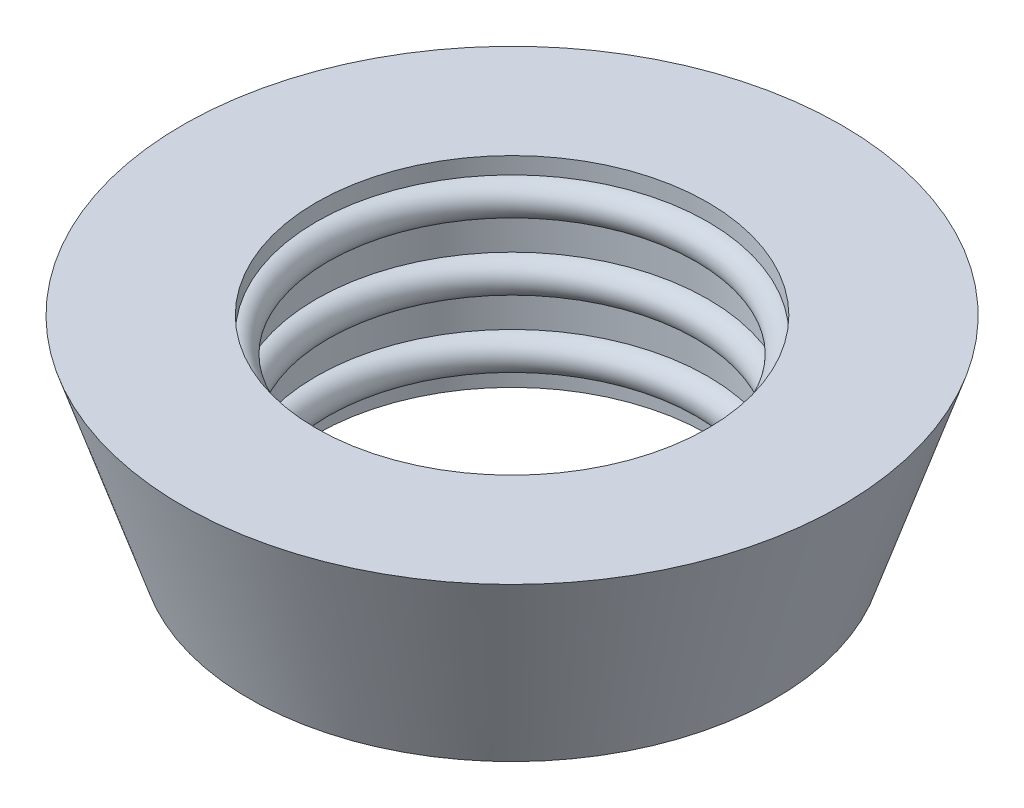
ISO-10303-21;
HEADER;
FILE_DESCRIPTION(('STEP AP214'),'2;1');
FILE_NAME('part.step','',(''),(''),'','','');
FILE_SCHEMA(('AUTOMOTIVE_DESIGN { 1 0 10303 214 1 1 1 1 }'));
ENDSEC;
DATA;
#1=APPLICATION_CONTEXT('core data for automotive mechanical design processes');
#2=APPLICATION_PROTOCOL_DEFINITION('international standard','automotive_design',2000,#1);
#3=PRODUCT_CONTEXT('',#1,'mechanical');
#4=PRODUCT('Part','Part','',(#3));
#5=PRODUCT_RELATED_PRODUCT_CATEGORY('part','',(#4));
#6=PRODUCT_DEFINITION_FORMATION('','',#4);
#7=PRODUCT_DEFINITION_CONTEXT('part definition',#1,'design');
#8=PRODUCT_DEFINITION('design','',#6,#7);
#9=PRODUCT_DEFINITION_SHAPE('','',#8);
#10=(LENGTH_UNIT() NAMED_UNIT(*) SI_UNIT(.MILLI.,.METRE.));
#11=(NAMED_UNIT(*) PLANE_ANGLE_UNIT() SI_UNIT($,.RADIAN.));
#12=(NAMED_UNIT(*) SI_UNIT($,.STERADIAN.) SOLID_ANGLE_UNIT());
#13=UNCERTAINTY_MEASURE_WITH_UNIT(LENGTH_MEASURE(1.E-05),#10,'distance_accuracy_value','');
#14=(GEOMETRIC_REPRESENTATION_CONTEXT(3) GLOBAL_UNCERTAINTY_ASSIGNED_CONTEXT((#13)) GLOBAL_UNIT_ASSIGNED_CONTEXT((#10,
#11,#12)) REPRESENTATION_CONTEXT('',''));
#15=CARTESIAN_POINT('',(0.,0.,0.));
#16=DIRECTION('',(0.,0.,1.));
#17=DIRECTION('',(1.,0.,0.));
#18=AXIS2_PLACEMENT_3D('',#15,#16,#17);
#19=CARTESIAN_POINT('',(0.,0.,0.));
#20=DIRECTION('',(0.,-1.,0.));
#21=DIRECTION('',(0.,0.,-1.));
#22=AXIS2_PLACEMENT_3D('',#19,#20,#21);
#23=CYLINDRICAL_SURFACE('',#22,5.85);
#24=CARTESIAN_POINT('',(0.,0.,0.));
#25=DIRECTION('',(0.,-1.,0.));
#26=DIRECTION('',(0.,0.,-1.));
#27=AXIS2_PLACEMENT_3D('',#24,#25,#26);
#28=CIRCLE('',#27,5.85);
#29=CARTESIAN_POINT('',(0.,0.,-5.85));
#30=VERTEX_POINT('',#29);
#31=EDGE_CURVE('E10',#30,#30,#28,.T.);
#32=ORIENTED_EDGE('',*,*,#31,.T.);
#33=EDGE_LOOP('',(#32));
#34=FACE_BOUND('',#33,.T.);
#35=CARTESIAN_POINT('',(0.,0.5,0.));
#36=DIRECTION('',(0.,-1.,0.));
#37=DIRECTION('',(0.,0.,-1.));
#38=AXIS2_PLACEMENT_3D('',#35,#36,#37);
#39=CIRCLE('',#38,5.85);
#40=CARTESIAN_POINT('',(0.,0.5,-5.85));
#41=VERTEX_POINT('',#40);
#42=EDGE_CURVE('E70',#41,#41,#39,.T.);
#43=ORIENTED_EDGE('',*,*,#42,.F.);
#44=EDGE_LOOP('',(#43));
#45=FACE_BOUND('',#44,.T.);
#46=ADVANCED_FACE('F36',(#34,#45),#23,.F.);
#47=CARTESIAN_POINT('',(5.85,0.,0.));
#48=DIRECTION('',(0.,-1.,0.));
#49=DIRECTION('',(0.,0.,-1.));
#50=AXIS2_PLACEMENT_3D('',#47,#48,#49);
#51=PLANE('',#50);
#52=CARTESIAN_POINT('',(0.,0.,0.));
#53=DIRECTION('',(0.,-1.,0.));
#54=DIRECTION('',(0.,0.,-1.));
#55=AXIS2_PLACEMENT_3D('',#52,#53,#54);
#56=CIRCLE('',#55,7.85);
#57=CARTESIAN_POINT('',(0.,0.,-7.85));
#58=VERTEX_POINT('',#57);
#59=EDGE_CURVE('E42',#58,#58,#56,.T.);
#60=ORIENTED_EDGE('',*,*,#59,.T.);
#61=EDGE_LOOP('',(#60));
#62=FACE_BOUND('',#61,.T.);
#63=ORIENTED_EDGE('',*,*,#31,.F.);
#64=EDGE_LOOP('',(#63));
#65=FACE_BOUND('',#64,.T.);
#66=ADVANCED_FACE('F78',(#62,#65),#51,.T.);
#67=CARTESIAN_POINT('',(0.,0.,0.));
#68=DIRECTION('',(0.,1.,0.));
#69=DIRECTION('',(0.,0.,1.));
#70=AXIS2_PLACEMENT_3D('',#67,#68,#69);
#71=CONICAL_SURFACE('',#70,7.85,0.321750554396642);
#72=CARTESIAN_POINT('',(0.,6.,0.));
#73=DIRECTION('',(0.,-1.,0.));
#74=DIRECTION('',(0.,0.,-1.));
#75=AXIS2_PLACEMENT_3D('',#72,#73,#74);
#76=CIRCLE('',#75,9.85);
#77=CARTESIAN_POINT('',(0.,6.,-9.85));
#78=VERTEX_POINT('',#77);
#79=EDGE_CURVE('E46',#78,#78,#76,.T.);
#80=ORIENTED_EDGE('',*,*,#79,.T.);
#81=EDGE_LOOP('',(#80));
#82=FACE_BOUND('',#81,.T.);
#83=ORIENTED_EDGE('',*,*,#59,.F.);
#84=EDGE_LOOP('',(#83));
#85=FACE_BOUND('',#84,.T.);
#86=ADVANCED_FACE('F82',(#82,#85),#71,.T.);
#87=CARTESIAN_POINT('',(9.85,6.,0.));
#88=DIRECTION('',(0.,1.,0.));
#89=DIRECTION('',(0.,0.,1.));
#90=AXIS2_PLACEMENT_3D('',#87,#88,#89);
#91=PLANE('',#90);
#92=CARTESIAN_POINT('',(0.,6.,0.));
#93=DIRECTION('',(0.,-1.,0.));
#94=DIRECTION('',(0.,0.,-1.));
#95=AXIS2_PLACEMENT_3D('',#92,#93,#94);
#96=CIRCLE('',#95,5.85);
#97=CARTESIAN_POINT('',(0.,6.,-5.85));
#98=VERTEX_POINT('',#97);
#99=EDGE_CURVE('E50',#98,#98,#96,.T.);
#100=ORIENTED_EDGE('',*,*,#99,.T.);
#101=EDGE_LOOP('',(#100));
#102=FACE_BOUND('',#101,.T.);
#103=ORIENTED_EDGE('',*,*,#79,.F.);
#104=EDGE_LOOP('',(#103));
#105=FACE_BOUND('',#104,.T.);
#106=ADVANCED_FACE('F86',(#102,#105),#91,.T.);
#107=CARTESIAN_POINT('',(0.,0.,0.));
#108=DIRECTION('',(0.,-1.,0.));
#109=DIRECTION('',(0.,0.,-1.));
#110=AXIS2_PLACEMENT_3D('',#107,#108,#109);
#111=CYLINDRICAL_SURFACE('',#110,5.85);
#112=CARTESIAN_POINT('',(0.,5.5,0.));
#113=DIRECTION('',(0.,-1.,0.));
#114=DIRECTION('',(0.,0.,-1.));
#115=AXIS2_PLACEMENT_3D('',#112,#113,#114);
#116=CIRCLE('',#115,5.85);
#117=CARTESIAN_POINT('',(0.,5.5,-5.85));
#118=VERTEX_POINT('',#117);
#119=EDGE_CURVE('E55',#118,#118,#116,.T.);
#120=ORIENTED_EDGE('',*,*,#119,.T.);
#121=EDGE_LOOP('',(#120));
#122=FACE_BOUND('',#121,.T.);
#123=ORIENTED_EDGE('',*,*,#99,.F.);
#124=EDGE_LOOP('',(#123));
#125=FACE_BOUND('',#124,.T.);
#126=ADVANCED_FACE('F93',(#122,#125),#111,.F.);
#127=CARTESIAN_POINT('',(0.,5.,0.));
#128=DIRECTION('',(0.,-1.,0.));
#129=DIRECTION('',(0.,0.,-1.));
#130=AXIS2_PLACEMENT_3D('',#127,#128,#129);
#131=TOROIDAL_SURFACE('',#130,5.85,0.5);
#132=CARTESIAN_POINT('',(0.,4.5,0.));
#133=DIRECTION('',(0.,-1.,0.));
#134=DIRECTION('',(0.,0.,-1.));
#135=AXIS2_PLACEMENT_3D('',#132,#133,#134);
#136=CIRCLE('',#135,5.85);
#137=CARTESIAN_POINT('',(0.,4.5,-5.85));
#138=VERTEX_POINT('',#137);
#139=EDGE_CURVE('E58',#138,#138,#136,.T.);
#140=ORIENTED_EDGE('',*,*,#139,.T.);
#141=EDGE_LOOP('',(#140));
#142=FACE_BOUND('',#141,.T.);
#143=ORIENTED_EDGE('',*,*,#119,.F.);
#144=EDGE_LOOP('',(#143));
#145=FACE_BOUND('',#144,.T.);
#146=ADVANCED_FACE('F97',(#142,#145),#131,.T.);
#147=CARTESIAN_POINT('',(0.,0.,0.));
#148=DIRECTION('',(0.,-1.,0.));
#149=DIRECTION('',(0.,0.,-1.));
#150=AXIS2_PLACEMENT_3D('',#147,#148,#149);
#151=CYLINDRICAL_SURFACE('',#150,5.85);
#152=CARTESIAN_POINT('',(0.,3.5,0.));
#153=DIRECTION('',(0.,-1.,0.));
#154=DIRECTION('',(0.,0.,-1.));
#155=AXIS2_PLACEMENT_3D('',#152,#153,#154);
#156=CIRCLE('',#155,5.85);
#157=CARTESIAN_POINT('',(0.,3.5,-5.85));
#158=VERTEX_POINT('',#157);
#159=EDGE_CURVE('E61',#158,#158,#156,.T.);
#160=ORIENTED_EDGE('',*,*,#159,.T.);
#161=EDGE_LOOP('',(#160));
#162=FACE_BOUND('',#161,.T.);
#163=ORIENTED_EDGE('',*,*,#139,.F.);
#164=EDGE_LOOP('',(#163));
#165=FACE_BOUND('',#164,.T.);
#166=ADVANCED_FACE('F101',(#162,#165),#151,.F.);
#167=CARTESIAN_POINT('',(0.,3.,0.));
#168=DIRECTION('',(0.,-1.,0.));
#169=DIRECTION('',(0.,0.,-1.));
#170=AXIS2_PLACEMENT_3D('',#167,#168,#169);
#171=TOROIDAL_SURFACE('',#170,5.85,0.5);
#172=CARTESIAN_POINT('',(0.,2.5,0.));
#173=DIRECTION('',(0.,-1.,0.));
#174=DIRECTION('',(0.,0.,-1.));
#175=AXIS2_PLACEMENT_3D('',#172,#173,#174);
#176=CIRCLE('',#175,5.85);
#177=CARTESIAN_POINT('',(0.,2.5,-5.85));
#178=VERTEX_POINT('',#177);
#179=EDGE_CURVE('E64',#178,#178,#176,.T.);
#180=ORIENTED_EDGE('',*,*,#179,.T.);
#181=EDGE_LOOP('',(#180));
#182=FACE_BOUND('',#181,.T.);
#183=ORIENTED_EDGE('',*,*,#159,.F.);
#184=EDGE_LOOP('',(#183));
#185=FACE_BOUND('',#184,.T.);
#186=ADVANCED_FACE('F105',(#182,#185),#171,.T.);
#187=CARTESIAN_POINT('',(0.,0.,0.));
#188=DIRECTION('',(0.,-1.,0.));
#189=DIRECTION('',(0.,0.,-1.));
#190=AXIS2_PLACEMENT_3D('',#187,#188,#189);
#191=CYLINDRICAL_SURFACE('',#190,5.85);
#192=CARTESIAN_POINT('',(0.,1.5,0.));
#193=DIRECTION('',(0.,-1.,0.));
#194=DIRECTION('',(0.,0.,-1.));
#195=AXIS2_PLACEMENT_3D('',#192,#193,#194);
#196=CIRCLE('',#195,5.85);
#197=CARTESIAN_POINT('',(0.,1.5,-5.85));
#198=VERTEX_POINT('',#197);
#199=EDGE_CURVE('E67',#198,#198,#196,.T.);
#200=ORIENTED_EDGE('',*,*,#199,.T.);
#201=EDGE_LOOP('',(#200));
#202=FACE_BOUND('',#201,.T.);
#203=ORIENTED_EDGE('',*,*,#179,.F.);
#204=EDGE_LOOP('',(#203));
#205=FACE_BOUND('',#204,.T.);
#206=ADVANCED_FACE('F109',(#202,#205),#191,.F.);
#207=CARTESIAN_POINT('',(0.,1.,0.));
#208=DIRECTION('',(0.,-1.,0.));
#209=DIRECTION('',(0.,0.,-1.));
#210=AXIS2_PLACEMENT_3D('',#207,#208,#209);
#211=TOROIDAL_SURFACE('',#210,5.85,0.5);
#212=ORIENTED_EDGE('',*,*,#42,.T.);
#213=EDGE_LOOP('',(#212));
#214=FACE_BOUND('',#213,.T.);
#215=ORIENTED_EDGE('',*,*,#199,.F.);
#216=EDGE_LOOP('',(#215));
#217=FACE_BOUND('',#216,.T.);
#218=ADVANCED_FACE('F74',(#214,#217),#211,.T.);
#219=CLOSED_SHELL('',(#46,#66,#86,#106,#126,#146,#166,#186,#206,#218));
#220=MANIFOLD_SOLID_BREP('B2',#219);
#221=ADVANCED_BREP_SHAPE_REPRESENTATION('',(#18,#220),#14);
#222=SHAPE_DEFINITION_REPRESENTATION(#9,#221);
ENDSEC;
END-ISO-10303-21;
